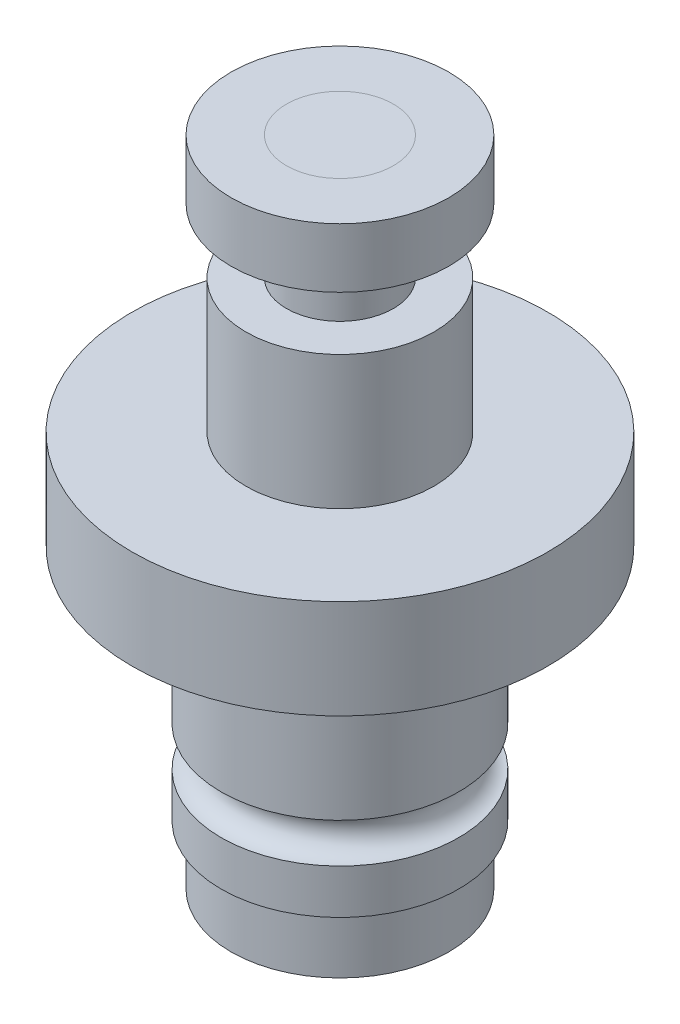
ISO-10303-21;
HEADER;
FILE_DESCRIPTION(('STEP AP214'),'2;1');
FILE_NAME('part.step','',(''),(''),'','','');
FILE_SCHEMA(('AUTOMOTIVE_DESIGN { 1 0 10303 214 1 1 1 1 }'));
ENDSEC;
DATA;
#1=APPLICATION_CONTEXT('core data for automotive mechanical design processes');
#2=APPLICATION_PROTOCOL_DEFINITION('international standard','automotive_design',2000,#1);
#3=PRODUCT_CONTEXT('',#1,'mechanical');
#4=PRODUCT('Part','Part','',(#3));
#5=PRODUCT_RELATED_PRODUCT_CATEGORY('part','',(#4));
#6=PRODUCT_DEFINITION_FORMATION('','',#4);
#7=PRODUCT_DEFINITION_CONTEXT('part definition',#1,'design');
#8=PRODUCT_DEFINITION('design','',#6,#7);
#9=PRODUCT_DEFINITION_SHAPE('','',#8);
#10=(LENGTH_UNIT() NAMED_UNIT(*) SI_UNIT(.MILLI.,.METRE.));
#11=(NAMED_UNIT(*) PLANE_ANGLE_UNIT() SI_UNIT($,.RADIAN.));
#12=(NAMED_UNIT(*) SI_UNIT($,.STERADIAN.) SOLID_ANGLE_UNIT());
#13=UNCERTAINTY_MEASURE_WITH_UNIT(LENGTH_MEASURE(1.E-05),#10,'distance_accuracy_value','');
#14=(GEOMETRIC_REPRESENTATION_CONTEXT(3) GLOBAL_UNCERTAINTY_ASSIGNED_CONTEXT((#13)) GLOBAL_UNIT_ASSIGNED_CONTEXT((#10,
#11,#12)) REPRESENTATION_CONTEXT('',''));
#15=CARTESIAN_POINT('',(0.,0.,0.));
#16=DIRECTION('',(0.,0.,1.));
#17=DIRECTION('',(1.,0.,0.));
#18=AXIS2_PLACEMENT_3D('',#15,#16,#17);
#19=CARTESIAN_POINT('',(0.,-17.5,0.));
#20=DIRECTION('',(0.,-1.,0.));
#21=DIRECTION('',(0.,0.,-1.));
#22=AXIS2_PLACEMENT_3D('',#19,#20,#21);
#23=PLANE('',#22);
#24=CARTESIAN_POINT('',(0.,-17.5,0.));
#25=DIRECTION('',(0.,-1.,0.));
#26=DIRECTION('',(0.,0.,-1.));
#27=AXIS2_PLACEMENT_3D('',#24,#25,#26);
#28=CIRCLE('',#27,5.5);
#29=CARTESIAN_POINT('',(0.,-17.5,-5.5));
#30=VERTEX_POINT('',#29);
#31=EDGE_CURVE('E11',#30,#30,#28,.T.);
#32=ORIENTED_EDGE('',*,*,#31,.T.);
#33=EDGE_LOOP('',(#32));
#34=FACE_BOUND('',#33,.T.);
#35=CARTESIAN_POINT('',(0.,-17.5,0.));
#36=DIRECTION('',(0.,-1.,0.));
#37=DIRECTION('',(0.,0.,-1.));
#38=AXIS2_PLACEMENT_3D('',#35,#36,#37);
#39=CIRCLE('',#38,2.5);
#40=CARTESIAN_POINT('',(0.,-17.5,-2.5));
#41=VERTEX_POINT('',#40);
#42=EDGE_CURVE('E54',#41,#41,#39,.T.);
#43=ORIENTED_EDGE('',*,*,#42,.F.);
#44=EDGE_LOOP('',(#43));
#45=FACE_BOUND('',#44,.T.);
#46=ADVANCED_FACE('F43',(#34,#45),#23,.T.);
#47=CARTESIAN_POINT('',(0.,-14.5,0.));
#48=DIRECTION('',(0.,-1.,0.));
#49=DIRECTION('',(0.,0.,-1.));
#50=AXIS2_PLACEMENT_3D('',#47,#48,#49);
#51=PLANE('',#50);
#52=CARTESIAN_POINT('',(0.,-14.5,0.));
#53=DIRECTION('',(0.,-1.,0.));
#54=DIRECTION('',(0.,0.,-1.));
#55=AXIS2_PLACEMENT_3D('',#52,#53,#54);
#56=CIRCLE('',#55,5.5);
#57=CARTESIAN_POINT('',(0.,-14.5,-5.5));
#58=VERTEX_POINT('',#57);
#59=EDGE_CURVE('E47',#58,#58,#56,.T.);
#60=ORIENTED_EDGE('',*,*,#59,.F.);
#61=EDGE_LOOP('',(#60));
#62=FACE_BOUND('',#61,.T.);
#63=CARTESIAN_POINT('',(0.,-14.5,0.));
#64=DIRECTION('',(0.,-1.,0.));
#65=DIRECTION('',(0.,0.,-1.));
#66=AXIS2_PLACEMENT_3D('',#63,#64,#65);
#67=CIRCLE('',#66,2.5);
#68=CARTESIAN_POINT('',(0.,-14.5,-2.5));
#69=VERTEX_POINT('',#68);
#70=EDGE_CURVE('E56',#69,#69,#67,.T.);
#71=ORIENTED_EDGE('',*,*,#70,.T.);
#72=EDGE_LOOP('',(#71));
#73=FACE_BOUND('',#72,.T.);
#74=ADVANCED_FACE('F66',(#62,#73),#51,.F.);
#75=CARTESIAN_POINT('',(0.,-17.5,0.));
#76=DIRECTION('',(0.,1.,0.));
#77=DIRECTION('',(0.,0.,1.));
#78=AXIS2_PLACEMENT_3D('',#75,#76,#77);
#79=CYLINDRICAL_SURFACE('',#78,5.5);
#80=ORIENTED_EDGE('',*,*,#31,.F.);
#81=EDGE_LOOP('',(#80));
#82=FACE_BOUND('',#81,.T.);
#83=ORIENTED_EDGE('',*,*,#59,.T.);
#84=EDGE_LOOP('',(#83));
#85=FACE_BOUND('',#84,.T.);
#86=ADVANCED_FACE('F45',(#82,#85),#79,.T.);
#87=CARTESIAN_POINT('',(0.,-17.5,0.));
#88=DIRECTION('',(0.,1.,0.));
#89=DIRECTION('',(0.,0.,1.));
#90=AXIS2_PLACEMENT_3D('',#87,#88,#89);
#91=CYLINDRICAL_SURFACE('',#90,2.5);
#92=ORIENTED_EDGE('',*,*,#42,.T.);
#93=EDGE_LOOP('',(#92));
#94=FACE_BOUND('',#93,.T.);
#95=ORIENTED_EDGE('',*,*,#70,.F.);
#96=EDGE_LOOP('',(#95));
#97=FACE_BOUND('',#96,.T.);
#98=ADVANCED_FACE('F62',(#94,#97),#91,.F.);
#99=CLOSED_SHELL('',(#46,#74,#86,#98));
#100=MANIFOLD_SOLID_BREP('B2',#99);
#101=CARTESIAN_POINT('',(0.,-14.5,0.));
#102=DIRECTION('',(0.,1.,0.));
#103=DIRECTION('',(0.,0.,1.));
#104=AXIS2_PLACEMENT_3D('',#101,#102,#103);
#105=CYLINDRICAL_SURFACE('',#104,6.);
#106=CARTESIAN_POINT('',(0.,-12.25,0.));
#107=DIRECTION('',(0.,1.,0.));
#108=DIRECTION('',(0.,0.,1.));
#109=AXIS2_PLACEMENT_3D('',#106,#107,#108);
#110=CIRCLE('',#109,6.);
#111=CARTESIAN_POINT('',(0.,-12.25,6.));
#112=VERTEX_POINT('',#111);
#113=EDGE_CURVE('E116',#112,#112,#110,.F.);
#114=ORIENTED_EDGE('',*,*,#113,.T.);
#115=EDGE_LOOP('',(#114));
#116=FACE_BOUND('',#115,.T.);
#117=CARTESIAN_POINT('',(0.,-14.5,0.));
#118=DIRECTION('',(0.,-1.,0.));
#119=DIRECTION('',(0.,0.,-1.));
#120=AXIS2_PLACEMENT_3D('',#117,#118,#119);
#121=CIRCLE('',#120,6.);
#122=CARTESIAN_POINT('',(0.,-14.5,-6.));
#123=VERTEX_POINT('',#122);
#124=EDGE_CURVE('E42',#123,#123,#121,.T.);
#125=ORIENTED_EDGE('',*,*,#124,.F.);
#126=EDGE_LOOP('',(#125));
#127=FACE_BOUND('',#126,.T.);
#128=ADVANCED_FACE('F112',(#116,#127),#105,.T.);
#129=CARTESIAN_POINT('',(0.,-14.5,0.));
#130=DIRECTION('',(0.,-1.,0.));
#131=DIRECTION('',(0.,0.,-1.));
#132=AXIS2_PLACEMENT_3D('',#129,#130,#131);
#133=PLANE('',#132);
#134=ORIENTED_EDGE('',*,*,#124,.T.);
#135=EDGE_LOOP('',(#134));
#136=FACE_BOUND('',#135,.T.);
#137=CARTESIAN_POINT('',(0.,-14.5,0.));
#138=DIRECTION('',(0.,-1.,0.));
#139=DIRECTION('',(0.,0.,-1.));
#140=AXIS2_PLACEMENT_3D('',#137,#138,#139);
#141=CIRCLE('',#140,2.5);
#142=CARTESIAN_POINT('',(0.,-14.5,-2.5));
#143=VERTEX_POINT('',#142);
#144=EDGE_CURVE('E125',#143,#143,#141,.T.);
#145=ORIENTED_EDGE('',*,*,#144,.F.);
#146=EDGE_LOOP('',(#145));
#147=FACE_BOUND('',#146,.T.);
#148=ADVANCED_FACE('F146',(#136,#147),#133,.T.);
#149=CARTESIAN_POINT('',(0.,-3.5,0.));
#150=DIRECTION('',(0.,-1.,0.));
#151=DIRECTION('',(0.,0.,-1.));
#152=AXIS2_PLACEMENT_3D('',#149,#150,#151);
#153=PLANE('',#152);
#154=CARTESIAN_POINT('',(0.,-3.5,0.));
#155=DIRECTION('',(0.,-1.,0.));
#156=DIRECTION('',(0.,0.,-1.));
#157=AXIS2_PLACEMENT_3D('',#154,#155,#156);
#158=CIRCLE('',#157,6.);
#159=CARTESIAN_POINT('',(0.,-3.5,-6.));
#160=VERTEX_POINT('',#159);
#161=EDGE_CURVE('E120',#160,#160,#158,.T.);
#162=ORIENTED_EDGE('',*,*,#161,.F.);
#163=EDGE_LOOP('',(#162));
#164=FACE_BOUND('',#163,.T.);
#165=CARTESIAN_POINT('',(0.,-3.5,0.));
#166=DIRECTION('',(0.,-1.,0.));
#167=DIRECTION('',(0.,0.,-1.));
#168=AXIS2_PLACEMENT_3D('',#165,#166,#167);
#169=CIRCLE('',#168,2.5);
#170=CARTESIAN_POINT('',(0.,-3.5,-2.5));
#171=VERTEX_POINT('',#170);
#172=EDGE_CURVE('E128',#171,#171,#169,.T.);
#173=ORIENTED_EDGE('',*,*,#172,.T.);
#174=EDGE_LOOP('',(#173));
#175=FACE_BOUND('',#174,.T.);
#176=ADVANCED_FACE('F148',(#164,#175),#153,.F.);
#177=CARTESIAN_POINT('',(0.,-10.25,0.));
#178=DIRECTION('',(0.,-1.,0.));
#179=DIRECTION('',(0.,0.,-1.));
#180=AXIS2_PLACEMENT_3D('',#177,#178,#179);
#181=CIRCLE('',#180,6.);
#182=CARTESIAN_POINT('',(0.,-10.25,-6.));
#183=VERTEX_POINT('',#182);
#184=EDGE_CURVE('E130',#183,#183,#181,.F.);
#185=ORIENTED_EDGE('',*,*,#184,.T.);
#186=EDGE_LOOP('',(#185));
#187=FACE_BOUND('',#186,.T.);
#188=ORIENTED_EDGE('',*,*,#161,.T.);
#189=EDGE_LOOP('',(#188));
#190=FACE_BOUND('',#189,.T.);
#191=ADVANCED_FACE('F114',(#187,#190),#105,.T.);
#192=CARTESIAN_POINT('',(0.,-14.5,0.));
#193=DIRECTION('',(0.,1.,0.));
#194=DIRECTION('',(0.,0.,1.));
#195=AXIS2_PLACEMENT_3D('',#192,#193,#194);
#196=CYLINDRICAL_SURFACE('',#195,2.5);
#197=ORIENTED_EDGE('',*,*,#144,.T.);
#198=EDGE_LOOP('',(#197));
#199=FACE_BOUND('',#198,.T.);
#200=ORIENTED_EDGE('',*,*,#172,.F.);
#201=EDGE_LOOP('',(#200));
#202=FACE_BOUND('',#201,.T.);
#203=ADVANCED_FACE('F143',(#199,#202),#196,.F.);
#204=CARTESIAN_POINT('',(0.,-11.25,0.));
#205=DIRECTION('',(0.,-1.,0.));
#206=DIRECTION('',(0.,0.,-1.));
#207=AXIS2_PLACEMENT_3D('',#204,#205,#206);
#208=TOROIDAL_SURFACE('',#207,6.,1.);
#209=ORIENTED_EDGE('',*,*,#184,.F.);
#210=EDGE_LOOP('',(#209));
#211=FACE_BOUND('',#210,.T.);
#212=ORIENTED_EDGE('',*,*,#113,.F.);
#213=EDGE_LOOP('',(#212));
#214=FACE_BOUND('',#213,.T.);
#215=ADVANCED_FACE('F158',(#211,#214),#208,.F.);
#216=CLOSED_SHELL('',(#128,#148,#176,#191,#203,#215));
#217=MANIFOLD_SOLID_BREP('B6',#216);
#218=CARTESIAN_POINT('',(0.,-3.5,0.));
#219=DIRECTION('',(0.,-1.,0.));
#220=DIRECTION('',(0.,0.,-1.));
#221=AXIS2_PLACEMENT_3D('',#218,#219,#220);
#222=PLANE('',#221);
#223=CARTESIAN_POINT('',(0.,-3.5,0.));
#224=DIRECTION('',(0.,-1.,0.));
#225=DIRECTION('',(0.,0.,-1.));
#226=AXIS2_PLACEMENT_3D('',#223,#224,#225);
#227=CIRCLE('',#226,4.875);
#228=CARTESIAN_POINT('',(0.,-3.5,-4.875));
#229=VERTEX_POINT('',#228);
#230=EDGE_CURVE('E111',#229,#229,#227,.T.);
#231=ORIENTED_EDGE('',*,*,#230,.T.);
#232=EDGE_LOOP('',(#231));
#233=FACE_BOUND('',#232,.T.);
#234=CARTESIAN_POINT('',(0.,-3.5,0.));
#235=DIRECTION('',(0.,-1.,0.));
#236=DIRECTION('',(0.,0.,-1.));
#237=AXIS2_PLACEMENT_3D('',#234,#235,#236);
#238=CIRCLE('',#237,2.5);
#239=CARTESIAN_POINT('',(0.,-3.5,-2.5));
#240=VERTEX_POINT('',#239);
#241=EDGE_CURVE('E241',#240,#240,#238,.T.);
#242=ORIENTED_EDGE('',*,*,#241,.F.);
#243=EDGE_LOOP('',(#242));
#244=FACE_BOUND('',#243,.T.);
#245=ADVANCED_FACE('F230',(#233,#244),#222,.T.);
#246=CARTESIAN_POINT('',(0.,-2.5,0.));
#247=DIRECTION('',(0.,-1.,0.));
#248=DIRECTION('',(0.,0.,-1.));
#249=AXIS2_PLACEMENT_3D('',#246,#247,#248);
#250=PLANE('',#249);
#251=CARTESIAN_POINT('',(0.,-2.5,0.));
#252=DIRECTION('',(0.,-1.,0.));
#253=DIRECTION('',(0.,0.,-1.));
#254=AXIS2_PLACEMENT_3D('',#251,#252,#253);
#255=CIRCLE('',#254,4.875);
#256=CARTESIAN_POINT('',(0.,-2.5,-4.875));
#257=VERTEX_POINT('',#256);
#258=EDGE_CURVE('E234',#257,#257,#255,.T.);
#259=ORIENTED_EDGE('',*,*,#258,.F.);
#260=EDGE_LOOP('',(#259));
#261=FACE_BOUND('',#260,.T.);
#262=CARTESIAN_POINT('',(0.,-2.5,0.));
#263=DIRECTION('',(0.,-1.,0.));
#264=DIRECTION('',(0.,0.,-1.));
#265=AXIS2_PLACEMENT_3D('',#262,#263,#264);
#266=CIRCLE('',#265,2.5);
#267=CARTESIAN_POINT('',(0.,-2.5,-2.5));
#268=VERTEX_POINT('',#267);
#269=EDGE_CURVE('E243',#268,#268,#266,.T.);
#270=ORIENTED_EDGE('',*,*,#269,.T.);
#271=EDGE_LOOP('',(#270));
#272=FACE_BOUND('',#271,.T.);
#273=ADVANCED_FACE('F253',(#261,#272),#250,.F.);
#274=CARTESIAN_POINT('',(0.,-3.5,0.));
#275=DIRECTION('',(0.,1.,0.));
#276=DIRECTION('',(0.,0.,1.));
#277=AXIS2_PLACEMENT_3D('',#274,#275,#276);
#278=CYLINDRICAL_SURFACE('',#277,4.875);
#279=ORIENTED_EDGE('',*,*,#230,.F.);
#280=EDGE_LOOP('',(#279));
#281=FACE_BOUND('',#280,.T.);
#282=ORIENTED_EDGE('',*,*,#258,.T.);
#283=EDGE_LOOP('',(#282));
#284=FACE_BOUND('',#283,.T.);
#285=ADVANCED_FACE('F232',(#281,#284),#278,.T.);
#286=CARTESIAN_POINT('',(0.,-3.5,0.));
#287=DIRECTION('',(0.,1.,0.));
#288=DIRECTION('',(0.,0.,1.));
#289=AXIS2_PLACEMENT_3D('',#286,#287,#288);
#290=CYLINDRICAL_SURFACE('',#289,2.5);
#291=ORIENTED_EDGE('',*,*,#241,.T.);
#292=EDGE_LOOP('',(#291));
#293=FACE_BOUND('',#292,.T.);
#294=ORIENTED_EDGE('',*,*,#269,.F.);
#295=EDGE_LOOP('',(#294));
#296=FACE_BOUND('',#295,.T.);
#297=ADVANCED_FACE('F249',(#293,#296),#290,.F.);
#298=CLOSED_SHELL('',(#245,#273,#285,#297));
#299=MANIFOLD_SOLID_BREP('B37',#298);
#300=CARTESIAN_POINT('',(0.,-17.5,0.));
#301=DIRECTION('',(0.,1.,0.));
#302=DIRECTION('',(0.,0.,1.));
#303=AXIS2_PLACEMENT_3D('',#300,#301,#302);
#304=CYLINDRICAL_SURFACE('',#303,2.5);
#305=CARTESIAN_POINT('',(0.,-17.5,0.));
#306=DIRECTION('',(0.,-1.,0.));
#307=DIRECTION('',(0.,0.,-1.));
#308=AXIS2_PLACEMENT_3D('',#305,#306,#307);
#309=CIRCLE('',#308,2.5);
#310=CARTESIAN_POINT('',(0.,-17.5,-2.5));
#311=VERTEX_POINT('',#310);
#312=EDGE_CURVE('E229',#311,#311,#309,.T.);
#313=ORIENTED_EDGE('',*,*,#312,.F.);
#314=EDGE_LOOP('',(#313));
#315=FACE_BOUND('',#314,.T.);
#316=CARTESIAN_POINT('',(0.,-2.5,0.));
#317=DIRECTION('',(0.,-1.,0.));
#318=DIRECTION('',(0.,0.,-1.));
#319=AXIS2_PLACEMENT_3D('',#316,#317,#318);
#320=CIRCLE('',#319,2.5);
#321=CARTESIAN_POINT('',(0.,-2.5,-2.5));
#322=VERTEX_POINT('',#321);
#323=EDGE_CURVE('E316',#322,#322,#320,.T.);
#324=ORIENTED_EDGE('',*,*,#323,.T.);
#325=EDGE_LOOP('',(#324));
#326=FACE_BOUND('',#325,.T.);
#327=ADVANCED_FACE('F313',(#315,#326),#304,.T.);
#328=CARTESIAN_POINT('',(0.,-17.5,0.));
#329=DIRECTION('',(0.,-1.,0.));
#330=DIRECTION('',(0.,0.,-1.));
#331=AXIS2_PLACEMENT_3D('',#328,#329,#330);
#332=PLANE('',#331);
#333=ORIENTED_EDGE('',*,*,#312,.T.);
#334=EDGE_LOOP('',(#333));
#335=FACE_BOUND('',#334,.T.);
#336=ADVANCED_FACE('F328',(#335),#332,.T.);
#337=CARTESIAN_POINT('',(0.,-2.5,0.));
#338=DIRECTION('',(0.,-1.,0.));
#339=DIRECTION('',(0.,0.,-1.));
#340=AXIS2_PLACEMENT_3D('',#337,#338,#339);
#341=PLANE('',#340);
#342=ORIENTED_EDGE('',*,*,#323,.F.);
#343=EDGE_LOOP('',(#342));
#344=FACE_BOUND('',#343,.T.);
#345=ADVANCED_FACE('F326',(#344),#341,.F.);
#346=CLOSED_SHELL('',(#327,#336,#345));
#347=MANIFOLD_SOLID_BREP('B106',#346);
#348=CARTESIAN_POINT('',(0.,12.5,0.));
#349=DIRECTION('',(0.,1.,0.));
#350=DIRECTION('',(0.,0.,1.));
#351=AXIS2_PLACEMENT_3D('',#348,#349,#350);
#352=CYLINDRICAL_SURFACE('',#351,5.5);
#353=CARTESIAN_POINT('',(0.,12.5,0.));
#354=DIRECTION('',(0.,1.,0.));
#355=DIRECTION('',(0.,0.,1.));
#356=AXIS2_PLACEMENT_3D('',#353,#354,#355);
#357=CIRCLE('',#356,5.5);
#358=CARTESIAN_POINT('',(0.,12.5,5.5));
#359=VERTEX_POINT('',#358);
#360=EDGE_CURVE('E312',#359,#359,#357,.T.);
#361=ORIENTED_EDGE('',*,*,#360,.T.);
#362=EDGE_LOOP('',(#361));
#363=FACE_BOUND('',#362,.T.);
#364=CARTESIAN_POINT('',(0.,15.5,0.));
#365=DIRECTION('',(0.,1.,0.));
#366=DIRECTION('',(0.,0.,1.));
#367=AXIS2_PLACEMENT_3D('',#364,#365,#366);
#368=CIRCLE('',#367,5.5);
#369=CARTESIAN_POINT('',(0.,15.5,5.5));
#370=VERTEX_POINT('',#369);
#371=EDGE_CURVE('E377',#370,#370,#368,.T.);
#372=ORIENTED_EDGE('',*,*,#371,.F.);
#373=EDGE_LOOP('',(#372));
#374=FACE_BOUND('',#373,.T.);
#375=ADVANCED_FACE('F374',(#363,#374),#352,.T.);
#376=CARTESIAN_POINT('',(0.,12.5,0.));
#377=DIRECTION('',(0.,1.,0.));
#378=DIRECTION('',(0.,0.,1.));
#379=AXIS2_PLACEMENT_3D('',#376,#377,#378);
#380=PLANE('',#379);
#381=CARTESIAN_POINT('',(0.,12.5,0.));
#382=DIRECTION('',(0.,1.,0.));
#383=DIRECTION('',(0.,0.,1.));
#384=AXIS2_PLACEMENT_3D('',#381,#382,#383);
#385=CIRCLE('',#384,2.7);
#386=CARTESIAN_POINT('',(0.,12.5,2.7));
#387=VERTEX_POINT('',#386);
#388=EDGE_CURVE('E384',#387,#387,#385,.T.);
#389=ORIENTED_EDGE('',*,*,#388,.T.);
#390=EDGE_LOOP('',(#389));
#391=FACE_BOUND('',#390,.T.);
#392=ORIENTED_EDGE('',*,*,#360,.F.);
#393=EDGE_LOOP('',(#392));
#394=FACE_BOUND('',#393,.T.);
#395=ADVANCED_FACE('F392',(#391,#394),#380,.F.);
#396=CARTESIAN_POINT('',(0.,15.5,0.));
#397=DIRECTION('',(0.,1.,0.));
#398=DIRECTION('',(0.,0.,1.));
#399=AXIS2_PLACEMENT_3D('',#396,#397,#398);
#400=PLANE('',#399);
#401=CARTESIAN_POINT('',(0.,15.5,0.));
#402=DIRECTION('',(0.,1.,0.));
#403=DIRECTION('',(0.,0.,1.));
#404=AXIS2_PLACEMENT_3D('',#401,#402,#403);
#405=CIRCLE('',#404,2.7);
#406=CARTESIAN_POINT('',(0.,15.5,2.7));
#407=VERTEX_POINT('',#406);
#408=EDGE_CURVE('E386',#407,#407,#405,.T.);
#409=ORIENTED_EDGE('',*,*,#408,.F.);
#410=EDGE_LOOP('',(#409));
#411=FACE_BOUND('',#410,.T.);
#412=ORIENTED_EDGE('',*,*,#371,.T.);
#413=EDGE_LOOP('',(#412));
#414=FACE_BOUND('',#413,.T.);
#415=ADVANCED_FACE('F398',(#411,#414),#400,.T.);
#416=CARTESIAN_POINT('',(0.,12.5,0.));
#417=DIRECTION('',(0.,1.,0.));
#418=DIRECTION('',(0.,0.,1.));
#419=AXIS2_PLACEMENT_3D('',#416,#417,#418);
#420=CYLINDRICAL_SURFACE('',#419,2.7);
#421=ORIENTED_EDGE('',*,*,#388,.F.);
#422=EDGE_LOOP('',(#421));
#423=FACE_BOUND('',#422,.T.);
#424=ORIENTED_EDGE('',*,*,#408,.T.);
#425=EDGE_LOOP('',(#424));
#426=FACE_BOUND('',#425,.T.);
#427=ADVANCED_FACE('F395',(#423,#426),#420,.F.);
#428=CLOSED_SHELL('',(#375,#395,#415,#427));
#429=MANIFOLD_SOLID_BREP('B224',#428);
#430=CARTESIAN_POINT('',(0.,-2.5,0.));
#431=DIRECTION('',(0.,1.,0.));
#432=DIRECTION('',(0.,0.,1.));
#433=AXIS2_PLACEMENT_3D('',#430,#431,#432);
#434=CYLINDRICAL_SURFACE('',#433,10.5);
#435=CARTESIAN_POINT('',(0.,-2.5,0.));
#436=DIRECTION('',(0.,1.,0.));
#437=DIRECTION('',(0.,0.,1.));
#438=AXIS2_PLACEMENT_3D('',#435,#436,#437);
#439=CIRCLE('',#438,10.5);
#440=CARTESIAN_POINT('',(0.,-2.5,10.5));
#441=VERTEX_POINT('',#440);
#442=EDGE_CURVE('E373',#441,#441,#439,.T.);
#443=ORIENTED_EDGE('',*,*,#442,.T.);
#444=EDGE_LOOP('',(#443));
#445=FACE_BOUND('',#444,.T.);
#446=CARTESIAN_POINT('',(0.,2.5,0.));
#447=DIRECTION('',(0.,1.,0.));
#448=DIRECTION('',(0.,0.,1.));
#449=AXIS2_PLACEMENT_3D('',#446,#447,#448);
#450=CIRCLE('',#449,10.5);
#451=CARTESIAN_POINT('',(0.,2.5,10.5));
#452=VERTEX_POINT('',#451);
#453=EDGE_CURVE('E459',#452,#452,#450,.T.);
#454=ORIENTED_EDGE('',*,*,#453,.F.);
#455=EDGE_LOOP('',(#454));
#456=FACE_BOUND('',#455,.T.);
#457=ADVANCED_FACE('F453',(#445,#456),#434,.T.);
#458=CARTESIAN_POINT('',(0.,-2.5,0.));
#459=DIRECTION('',(0.,1.,0.));
#460=DIRECTION('',(0.,0.,1.));
#461=AXIS2_PLACEMENT_3D('',#458,#459,#460);
#462=PLANE('',#461);
#463=ORIENTED_EDGE('',*,*,#442,.F.);
#464=EDGE_LOOP('',(#463));
#465=FACE_BOUND('',#464,.T.);
#466=ADVANCED_FACE('F501',(#465),#462,.F.);
#467=CARTESIAN_POINT('',(0.,2.5,0.));
#468=DIRECTION('',(0.,1.,0.));
#469=DIRECTION('',(0.,0.,1.));
#470=AXIS2_PLACEMENT_3D('',#467,#468,#469);
#471=PLANE('',#470);
#472=CARTESIAN_POINT('',(0.,2.5,0.));
#473=DIRECTION('',(0.,1.,0.));
#474=DIRECTION('',(0.,0.,1.));
#475=AXIS2_PLACEMENT_3D('',#472,#473,#474);
#476=CIRCLE('',#475,4.75);
#477=CARTESIAN_POINT('',(0.,2.5,4.75));
#478=VERTEX_POINT('',#477);
#479=EDGE_CURVE('E467',#478,#478,#476,.T.);
#480=ORIENTED_EDGE('',*,*,#479,.F.);
#481=EDGE_LOOP('',(#480));
#482=FACE_BOUND('',#481,.T.);
#483=ORIENTED_EDGE('',*,*,#453,.T.);
#484=EDGE_LOOP('',(#483));
#485=FACE_BOUND('',#484,.T.);
#486=ADVANCED_FACE('F496',(#482,#485),#471,.T.);
#487=CARTESIAN_POINT('',(0.,9.25,0.));
#488=DIRECTION('',(0.,-1.,0.));
#489=DIRECTION('',(0.,0.,-1.));
#490=AXIS2_PLACEMENT_3D('',#487,#488,#489);
#491=CYLINDRICAL_SURFACE('',#490,4.75);
#492=CARTESIAN_POINT('',(0.,9.25,0.));
#493=DIRECTION('',(0.,1.,0.));
#494=DIRECTION('',(0.,0.,1.));
#495=AXIS2_PLACEMENT_3D('',#492,#493,#494);
#496=CIRCLE('',#495,4.75);
#497=CARTESIAN_POINT('',(0.,9.25,4.75));
#498=VERTEX_POINT('',#497);
#499=EDGE_CURVE('E463',#498,#498,#496,.T.);
#500=ORIENTED_EDGE('',*,*,#499,.F.);
#501=EDGE_LOOP('',(#500));
#502=FACE_BOUND('',#501,.T.);
#503=ORIENTED_EDGE('',*,*,#479,.T.);
#504=EDGE_LOOP('',(#503));
#505=FACE_BOUND('',#504,.T.);
#506=ADVANCED_FACE('F490',(#502,#505),#491,.T.);
#507=CARTESIAN_POINT('',(0.,9.25,0.));
#508=DIRECTION('',(0.,1.,0.));
#509=DIRECTION('',(0.,0.,1.));
#510=AXIS2_PLACEMENT_3D('',#507,#508,#509);
#511=PLANE('',#510);
#512=CARTESIAN_POINT('',(0.,9.25,0.));
#513=DIRECTION('',(0.,1.,0.));
#514=DIRECTION('',(0.,0.,1.));
#515=AXIS2_PLACEMENT_3D('',#512,#513,#514);
#516=CIRCLE('',#515,2.7);
#517=CARTESIAN_POINT('',(0.,9.25,2.7));
#518=VERTEX_POINT('',#517);
#519=EDGE_CURVE('E473',#518,#518,#516,.T.);
#520=ORIENTED_EDGE('',*,*,#519,.F.);
#521=EDGE_LOOP('',(#520));
#522=FACE_BOUND('',#521,.T.);
#523=ORIENTED_EDGE('',*,*,#499,.T.);
#524=EDGE_LOOP('',(#523));
#525=FACE_BOUND('',#524,.T.);
#526=ADVANCED_FACE('F484',(#522,#525),#511,.T.);
#527=CARTESIAN_POINT('',(0.,15.5,0.));
#528=DIRECTION('',(0.,-1.,0.));
#529=DIRECTION('',(0.,0.,-1.));
#530=AXIS2_PLACEMENT_3D('',#527,#528,#529);
#531=CYLINDRICAL_SURFACE('',#530,2.7);
#532=CARTESIAN_POINT('',(0.,15.5,0.));
#533=DIRECTION('',(0.,1.,0.));
#534=DIRECTION('',(0.,0.,1.));
#535=AXIS2_PLACEMENT_3D('',#532,#533,#534);
#536=CIRCLE('',#535,2.7);
#537=CARTESIAN_POINT('',(0.,15.5,2.7));
#538=VERTEX_POINT('',#537);
#539=EDGE_CURVE('E471',#538,#538,#536,.T.);
#540=ORIENTED_EDGE('',*,*,#539,.F.);
#541=EDGE_LOOP('',(#540));
#542=FACE_BOUND('',#541,.T.);
#543=ORIENTED_EDGE('',*,*,#519,.T.);
#544=EDGE_LOOP('',(#543));
#545=FACE_BOUND('',#544,.T.);
#546=ADVANCED_FACE('F481',(#542,#545),#531,.T.);
#547=CARTESIAN_POINT('',(0.,15.5,0.));
#548=DIRECTION('',(0.,1.,0.));
#549=DIRECTION('',(0.,0.,1.));
#550=AXIS2_PLACEMENT_3D('',#547,#548,#549);
#551=PLANE('',#550);
#552=ORIENTED_EDGE('',*,*,#539,.T.);
#553=EDGE_LOOP('',(#552));
#554=FACE_BOUND('',#553,.T.);
#555=ADVANCED_FACE('F479',(#554),#551,.T.);
#556=CLOSED_SHELL('',(#457,#466,#486,#506,#526,#546,#555));
#557=MANIFOLD_SOLID_BREP('B307',#556);
#558=ADVANCED_BREP_SHAPE_REPRESENTATION('',(#18,#100,#217,#299,#347,#429,#557),#14);
#559=SHAPE_DEFINITION_REPRESENTATION(#9,#558);
ENDSEC;
END-ISO-10303-21;
